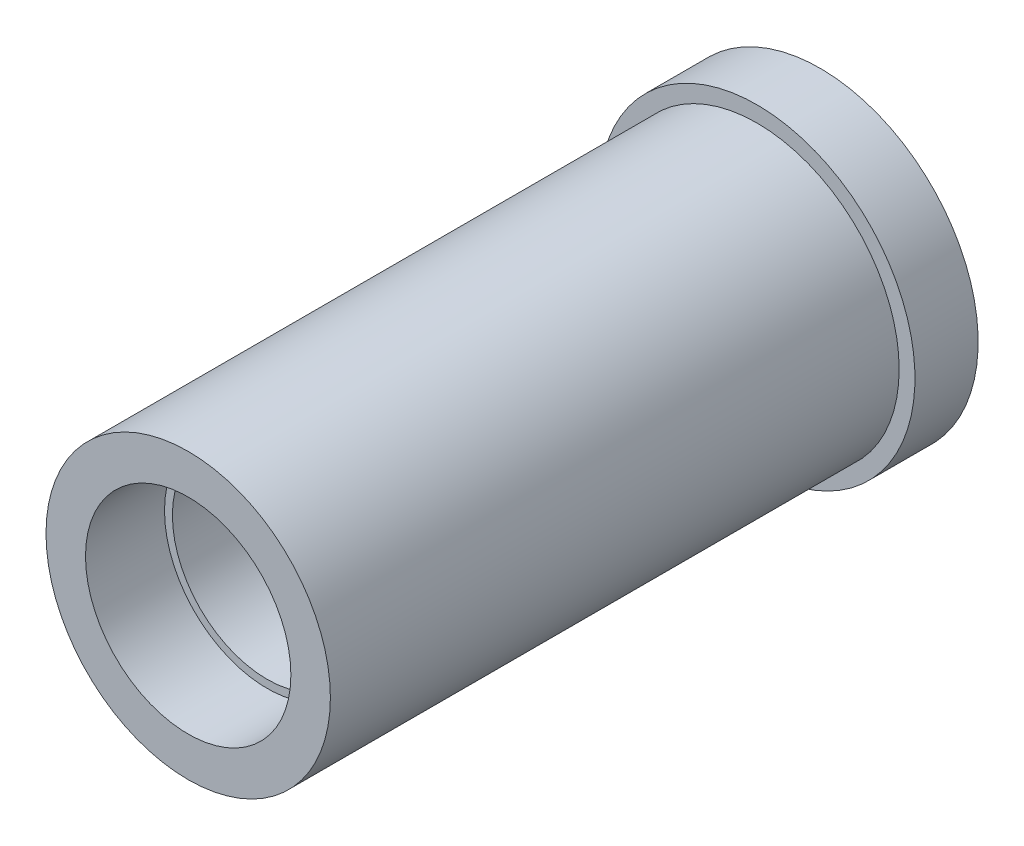
ISO-10303-21;
HEADER;
FILE_DESCRIPTION(('STEP AP214'),'2;1');
FILE_NAME('part.step','',(''),(''),'','','');
FILE_SCHEMA(('AUTOMOTIVE_DESIGN { 1 0 10303 214 1 1 1 1 }'));
ENDSEC;
DATA;
#1=APPLICATION_CONTEXT('core data for automotive mechanical design processes');
#2=APPLICATION_PROTOCOL_DEFINITION('international standard','automotive_design',2000,#1);
#3=PRODUCT_CONTEXT('',#1,'mechanical');
#4=PRODUCT('Part','Part','',(#3));
#5=PRODUCT_RELATED_PRODUCT_CATEGORY('part','',(#4));
#6=PRODUCT_DEFINITION_FORMATION('','',#4);
#7=PRODUCT_DEFINITION_CONTEXT('part definition',#1,'design');
#8=PRODUCT_DEFINITION('design','',#6,#7);
#9=PRODUCT_DEFINITION_SHAPE('','',#8);
#10=(LENGTH_UNIT() NAMED_UNIT(*) SI_UNIT(.MILLI.,.METRE.));
#11=(NAMED_UNIT(*) PLANE_ANGLE_UNIT() SI_UNIT($,.RADIAN.));
#12=(NAMED_UNIT(*) SI_UNIT($,.STERADIAN.) SOLID_ANGLE_UNIT());
#13=UNCERTAINTY_MEASURE_WITH_UNIT(LENGTH_MEASURE(1.E-05),#10,'distance_accuracy_value','');
#14=(GEOMETRIC_REPRESENTATION_CONTEXT(3) GLOBAL_UNCERTAINTY_ASSIGNED_CONTEXT((#13)) GLOBAL_UNIT_ASSIGNED_CONTEXT((#10,
#11,#12)) REPRESENTATION_CONTEXT('',''));
#15=CARTESIAN_POINT('',(0.,0.,0.));
#16=DIRECTION('',(0.,0.,1.));
#17=DIRECTION('',(1.,0.,0.));
#18=AXIS2_PLACEMENT_3D('',#15,#16,#17);
#19=CARTESIAN_POINT('',(0.,0.,40.));
#20=DIRECTION('',(0.,0.,-1.));
#21=DIRECTION('',(-1.,0.,0.));
#22=AXIS2_PLACEMENT_3D('',#19,#20,#21);
#23=CYLINDRICAL_SURFACE('',#22,9.);
#24=CARTESIAN_POINT('',(0.,0.,40.));
#25=DIRECTION('',(0.,0.,1.));
#26=DIRECTION('',(1.,0.,0.));
#27=AXIS2_PLACEMENT_3D('',#24,#25,#26);
#28=CIRCLE('',#27,9.);
#29=CARTESIAN_POINT('',(9.,0.,40.));
#30=VERTEX_POINT('',#29);
#31=EDGE_CURVE('E39',#30,#30,#28,.T.);
#32=ORIENTED_EDGE('',*,*,#31,.F.);
#33=EDGE_LOOP('',(#32));
#34=FACE_BOUND('',#33,.T.);
#35=CARTESIAN_POINT('',(0.,0.,4.));
#36=DIRECTION('',(0.,0.,-1.));
#37=DIRECTION('',(-1.,0.,0.));
#38=AXIS2_PLACEMENT_3D('',#35,#36,#37);
#39=CIRCLE('',#38,9.);
#40=CARTESIAN_POINT('',(-9.,0.,4.));
#41=VERTEX_POINT('',#40);
#42=EDGE_CURVE('E10',#41,#41,#39,.T.);
#43=ORIENTED_EDGE('',*,*,#42,.F.);
#44=EDGE_LOOP('',(#43));
#45=FACE_BOUND('',#44,.T.);
#46=ADVANCED_FACE('F33',(#34,#45),#23,.T.);
#47=CARTESIAN_POINT('',(0.,0.,40.));
#48=DIRECTION('',(0.,0.,-1.));
#49=DIRECTION('',(-1.,0.,0.));
#50=AXIS2_PLACEMENT_3D('',#47,#48,#49);
#51=CYLINDRICAL_SURFACE('',#50,6.);
#52=CARTESIAN_POINT('',(0.,0.,35.));
#53=DIRECTION('',(0.,0.,1.));
#54=DIRECTION('',(1.,0.,0.));
#55=AXIS2_PLACEMENT_3D('',#52,#53,#54);
#56=CIRCLE('',#55,6.);
#57=CARTESIAN_POINT('',(6.,0.,35.));
#58=VERTEX_POINT('',#57);
#59=EDGE_CURVE('E43',#58,#58,#56,.T.);
#60=ORIENTED_EDGE('',*,*,#59,.T.);
#61=EDGE_LOOP('',(#60));
#62=FACE_BOUND('',#61,.T.);
#63=CARTESIAN_POINT('',(0.,0.,5.));
#64=DIRECTION('',(0.,0.,-1.));
#65=DIRECTION('',(-1.,0.,0.));
#66=AXIS2_PLACEMENT_3D('',#63,#64,#65);
#67=CIRCLE('',#66,6.);
#68=CARTESIAN_POINT('',(-6.,0.,5.));
#69=VERTEX_POINT('',#68);
#70=EDGE_CURVE('E53',#69,#69,#67,.T.);
#71=ORIENTED_EDGE('',*,*,#70,.T.);
#72=EDGE_LOOP('',(#71));
#73=FACE_BOUND('',#72,.T.);
#74=ADVANCED_FACE('F84',(#62,#73),#51,.F.);
#75=CARTESIAN_POINT('',(0.,0.,40.));
#76=DIRECTION('',(0.,0.,1.));
#77=DIRECTION('',(1.,0.,0.));
#78=AXIS2_PLACEMENT_3D('',#75,#76,#77);
#79=PLANE('',#78);
#80=CARTESIAN_POINT('',(0.,0.,40.));
#81=DIRECTION('',(0.,0.,1.));
#82=DIRECTION('',(1.,0.,0.));
#83=AXIS2_PLACEMENT_3D('',#80,#81,#82);
#84=CIRCLE('',#83,6.5);
#85=CARTESIAN_POINT('',(6.5,0.,40.));
#86=VERTEX_POINT('',#85);
#87=EDGE_CURVE('E51',#86,#86,#84,.T.);
#88=ORIENTED_EDGE('',*,*,#87,.F.);
#89=EDGE_LOOP('',(#88));
#90=FACE_BOUND('',#89,.T.);
#91=ORIENTED_EDGE('',*,*,#31,.T.);
#92=EDGE_LOOP('',(#91));
#93=FACE_BOUND('',#92,.T.);
#94=ADVANCED_FACE('F82',(#90,#93),#79,.T.);
#95=CARTESIAN_POINT('',(0.,0.,0.));
#96=DIRECTION('',(0.,0.,1.));
#97=DIRECTION('',(1.,0.,0.));
#98=AXIS2_PLACEMENT_3D('',#95,#96,#97);
#99=PLANE('',#98);
#100=CARTESIAN_POINT('',(0.,0.,0.));
#101=DIRECTION('',(0.,0.,-1.));
#102=DIRECTION('',(-1.,0.,0.));
#103=AXIS2_PLACEMENT_3D('',#100,#101,#102);
#104=CIRCLE('',#103,6.5);
#105=CARTESIAN_POINT('',(-6.5,0.,0.));
#106=VERTEX_POINT('',#105);
#107=EDGE_CURVE('E60',#106,#106,#104,.T.);
#108=ORIENTED_EDGE('',*,*,#107,.F.);
#109=EDGE_LOOP('',(#108));
#110=FACE_BOUND('',#109,.T.);
#111=CARTESIAN_POINT('',(0.,0.,0.));
#112=DIRECTION('',(0.,0.,-1.));
#113=DIRECTION('',(-1.,0.,0.));
#114=AXIS2_PLACEMENT_3D('',#111,#112,#113);
#115=CIRCLE('',#114,10.);
#116=CARTESIAN_POINT('',(-10.,0.,0.));
#117=VERTEX_POINT('',#116);
#118=EDGE_CURVE('E68',#117,#117,#115,.T.);
#119=ORIENTED_EDGE('',*,*,#118,.T.);
#120=EDGE_LOOP('',(#119));
#121=FACE_BOUND('',#120,.T.);
#122=ADVANCED_FACE('F78',(#110,#121),#99,.F.);
#123=CARTESIAN_POINT('',(0.,0.,35.));
#124=DIRECTION('',(0.,0.,1.));
#125=DIRECTION('',(1.,0.,0.));
#126=AXIS2_PLACEMENT_3D('',#123,#124,#125);
#127=CYLINDRICAL_SURFACE('',#126,6.5);
#128=CARTESIAN_POINT('',(0.,0.,35.));
#129=DIRECTION('',(0.,0.,1.));
#130=DIRECTION('',(1.,0.,0.));
#131=AXIS2_PLACEMENT_3D('',#128,#129,#130);
#132=CIRCLE('',#131,6.5);
#133=CARTESIAN_POINT('',(6.5,0.,35.));
#134=VERTEX_POINT('',#133);
#135=EDGE_CURVE('E48',#134,#134,#132,.T.);
#136=ORIENTED_EDGE('',*,*,#135,.F.);
#137=EDGE_LOOP('',(#136));
#138=FACE_BOUND('',#137,.T.);
#139=ORIENTED_EDGE('',*,*,#87,.T.);
#140=EDGE_LOOP('',(#139));
#141=FACE_BOUND('',#140,.T.);
#142=ADVANCED_FACE('F75',(#138,#141),#127,.F.);
#143=CARTESIAN_POINT('',(0.,0.,35.));
#144=DIRECTION('',(0.,0.,1.));
#145=DIRECTION('',(1.,0.,0.));
#146=AXIS2_PLACEMENT_3D('',#143,#144,#145);
#147=PLANE('',#146);
#148=ORIENTED_EDGE('',*,*,#59,.F.);
#149=EDGE_LOOP('',(#148));
#150=FACE_BOUND('',#149,.T.);
#151=ORIENTED_EDGE('',*,*,#135,.T.);
#152=EDGE_LOOP('',(#151));
#153=FACE_BOUND('',#152,.T.);
#154=ADVANCED_FACE('F73',(#150,#153),#147,.T.);
#155=CARTESIAN_POINT('',(0.,0.,5.));
#156=DIRECTION('',(0.,0.,-1.));
#157=DIRECTION('',(-1.,0.,0.));
#158=AXIS2_PLACEMENT_3D('',#155,#156,#157);
#159=CYLINDRICAL_SURFACE('',#158,6.5);
#160=CARTESIAN_POINT('',(0.,0.,5.));
#161=DIRECTION('',(0.,0.,-1.));
#162=DIRECTION('',(-1.,0.,0.));
#163=AXIS2_PLACEMENT_3D('',#160,#161,#162);
#164=CIRCLE('',#163,6.5);
#165=CARTESIAN_POINT('',(-6.5,0.,5.));
#166=VERTEX_POINT('',#165);
#167=EDGE_CURVE('E55',#166,#166,#164,.T.);
#168=ORIENTED_EDGE('',*,*,#167,.F.);
#169=EDGE_LOOP('',(#168));
#170=FACE_BOUND('',#169,.T.);
#171=ORIENTED_EDGE('',*,*,#107,.T.);
#172=EDGE_LOOP('',(#171));
#173=FACE_BOUND('',#172,.T.);
#174=ADVANCED_FACE('F136',(#170,#173),#159,.F.);
#175=CARTESIAN_POINT('',(0.,0.,5.));
#176=DIRECTION('',(0.,0.,-1.));
#177=DIRECTION('',(-1.,0.,0.));
#178=AXIS2_PLACEMENT_3D('',#175,#176,#177);
#179=PLANE('',#178);
#180=ORIENTED_EDGE('',*,*,#70,.F.);
#181=EDGE_LOOP('',(#180));
#182=FACE_BOUND('',#181,.T.);
#183=ORIENTED_EDGE('',*,*,#167,.T.);
#184=EDGE_LOOP('',(#183));
#185=FACE_BOUND('',#184,.T.);
#186=ADVANCED_FACE('F105',(#182,#185),#179,.T.);
#187=CARTESIAN_POINT('',(0.,0.,4.));
#188=DIRECTION('',(0.,0.,-1.));
#189=DIRECTION('',(-1.,0.,0.));
#190=AXIS2_PLACEMENT_3D('',#187,#188,#189);
#191=CYLINDRICAL_SURFACE('',#190,10.);
#192=CARTESIAN_POINT('',(0.,0.,4.));
#193=DIRECTION('',(0.,0.,-1.));
#194=DIRECTION('',(-1.,0.,0.));
#195=AXIS2_PLACEMENT_3D('',#192,#193,#194);
#196=CIRCLE('',#195,10.);
#197=CARTESIAN_POINT('',(-10.,0.,4.));
#198=VERTEX_POINT('',#197);
#199=EDGE_CURVE('E65',#198,#198,#196,.T.);
#200=ORIENTED_EDGE('',*,*,#199,.T.);
#201=EDGE_LOOP('',(#200));
#202=FACE_BOUND('',#201,.T.);
#203=ORIENTED_EDGE('',*,*,#118,.F.);
#204=EDGE_LOOP('',(#203));
#205=FACE_BOUND('',#204,.T.);
#206=ADVANCED_FACE('F117',(#202,#205),#191,.T.);
#207=CARTESIAN_POINT('',(0.,0.,4.));
#208=DIRECTION('',(0.,0.,-1.));
#209=DIRECTION('',(-1.,0.,0.));
#210=AXIS2_PLACEMENT_3D('',#207,#208,#209);
#211=PLANE('',#210);
#212=ORIENTED_EDGE('',*,*,#42,.T.);
#213=EDGE_LOOP('',(#212));
#214=FACE_BOUND('',#213,.T.);
#215=ORIENTED_EDGE('',*,*,#199,.F.);
#216=EDGE_LOOP('',(#215));
#217=FACE_BOUND('',#216,.T.);
#218=ADVANCED_FACE('F120',(#214,#217),#211,.F.);
#219=CLOSED_SHELL('',(#46,#74,#94,#122,#142,#154,#174,#186,#206,#218));
#220=MANIFOLD_SOLID_BREP('B2',#219);
#221=ADVANCED_BREP_SHAPE_REPRESENTATION('',(#18,#220),#14);
#222=SHAPE_DEFINITION_REPRESENTATION(#9,#221);
ENDSEC;
END-ISO-10303-21;
